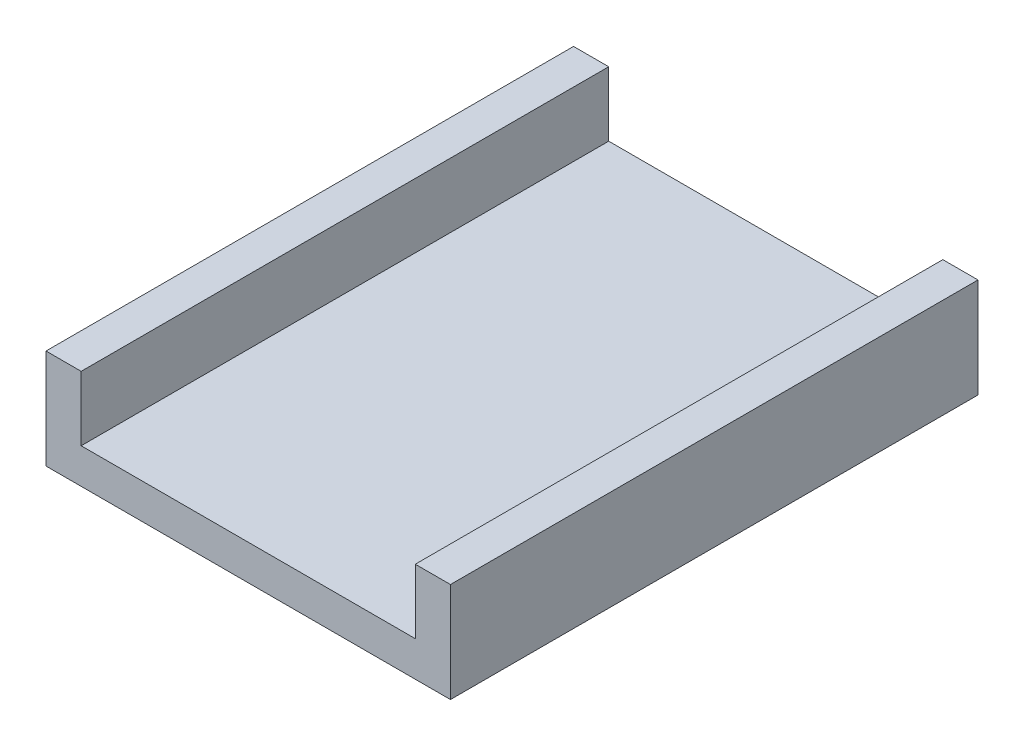
ISO-10303-21;
HEADER;
FILE_DESCRIPTION(('STEP AP214'),'2;1');
FILE_NAME('part.step','',(''),(''),'','','');
FILE_SCHEMA(('AUTOMOTIVE_DESIGN { 1 0 10303 214 1 1 1 1 }'));
ENDSEC;
DATA;
#1=APPLICATION_CONTEXT('core data for automotive mechanical design processes');
#2=APPLICATION_PROTOCOL_DEFINITION('international standard','automotive_design',2000,#1);
#3=PRODUCT_CONTEXT('',#1,'mechanical');
#4=PRODUCT('Part','Part','',(#3));
#5=PRODUCT_RELATED_PRODUCT_CATEGORY('part','',(#4));
#6=PRODUCT_DEFINITION_FORMATION('','',#4);
#7=PRODUCT_DEFINITION_CONTEXT('part definition',#1,'design');
#8=PRODUCT_DEFINITION('design','',#6,#7);
#9=PRODUCT_DEFINITION_SHAPE('','',#8);
#10=(LENGTH_UNIT() NAMED_UNIT(*) SI_UNIT(.MILLI.,.METRE.));
#11=(NAMED_UNIT(*) PLANE_ANGLE_UNIT() SI_UNIT($,.RADIAN.));
#12=(NAMED_UNIT(*) SI_UNIT($,.STERADIAN.) SOLID_ANGLE_UNIT());
#13=UNCERTAINTY_MEASURE_WITH_UNIT(LENGTH_MEASURE(1.E-05),#10,'distance_accuracy_value','');
#14=(GEOMETRIC_REPRESENTATION_CONTEXT(3) GLOBAL_UNCERTAINTY_ASSIGNED_CONTEXT((#13)) GLOBAL_UNIT_ASSIGNED_CONTEXT((#10,
#11,#12)) REPRESENTATION_CONTEXT('',''));
#15=CARTESIAN_POINT('',(0.,0.,0.));
#16=DIRECTION('',(0.,0.,1.));
#17=DIRECTION('',(1.,0.,0.));
#18=AXIS2_PLACEMENT_3D('',#15,#16,#17);
#19=CARTESIAN_POINT('',(0.,3.,0.));
#20=DIRECTION('',(0.,-1.,0.));
#21=DIRECTION('',(0.,0.,-1.));
#22=AXIS2_PLACEMENT_3D('',#19,#20,#21);
#23=PLANE('',#22);
#24=DIRECTION('',(0.,0.,1.));
#25=VECTOR('',#24,1.);
#26=CARTESIAN_POINT('',(14.25,3.,-22.5));
#27=LINE('',#26,#25);
#28=CARTESIAN_POINT('',(14.25,3.,-22.5));
#29=VERTEX_POINT('',#28);
#30=CARTESIAN_POINT('',(14.25,3.,22.5));
#31=VERTEX_POINT('',#30);
#32=EDGE_CURVE('E53',#29,#31,#27,.T.);
#33=ORIENTED_EDGE('',*,*,#32,.F.);
#34=DIRECTION('',(-1.,0.,0.));
#35=VECTOR('',#34,1.);
#36=CARTESIAN_POINT('',(-17.25,3.,-22.5));
#37=LINE('',#36,#35);
#38=CARTESIAN_POINT('',(-14.25,3.,-22.5));
#39=VERTEX_POINT('',#38);
#40=EDGE_CURVE('E39',#29,#39,#37,.T.);
#41=ORIENTED_EDGE('',*,*,#40,.T.);
#42=DIRECTION('',(0.,0.,-1.));
#43=VECTOR('',#42,1.);
#44=CARTESIAN_POINT('',(-14.25,3.,-22.5));
#45=LINE('',#44,#43);
#46=CARTESIAN_POINT('',(-14.25,3.,22.5));
#47=VERTEX_POINT('',#46);
#48=EDGE_CURVE('E123',#47,#39,#45,.T.);
#49=ORIENTED_EDGE('',*,*,#48,.F.);
#50=DIRECTION('',(1.,0.,0.));
#51=VECTOR('',#50,1.);
#52=CARTESIAN_POINT('',(-17.25,3.,22.5));
#53=LINE('',#52,#51);
#54=EDGE_CURVE('E58',#47,#31,#53,.T.);
#55=ORIENTED_EDGE('',*,*,#54,.T.);
#56=EDGE_LOOP('',(#33,#41,#49,#55));
#57=FACE_BOUND('',#56,.T.);
#58=ADVANCED_FACE('F35',(#57),#23,.F.);
#59=CARTESIAN_POINT('',(17.25,3.,22.5));
#60=DIRECTION('',(-1.,0.,0.));
#61=DIRECTION('',(0.,0.,1.));
#62=AXIS2_PLACEMENT_3D('',#59,#60,#61);
#63=PLANE('',#62);
#64=DIRECTION('',(0.,0.,-1.));
#65=VECTOR('',#64,1.);
#66=CARTESIAN_POINT('',(17.25,0.,22.5));
#67=LINE('',#66,#65);
#68=CARTESIAN_POINT('',(17.25,0.,22.5));
#69=VERTEX_POINT('',#68);
#70=CARTESIAN_POINT('',(17.25,0.,-22.5));
#71=VERTEX_POINT('',#70);
#72=EDGE_CURVE('E151',#69,#71,#67,.T.);
#73=ORIENTED_EDGE('',*,*,#72,.T.);
#74=DIRECTION('',(0.,-1.,0.));
#75=VECTOR('',#74,1.);
#76=CARTESIAN_POINT('',(17.25,3.,-22.5));
#77=LINE('',#76,#75);
#78=CARTESIAN_POINT('',(17.25,8.5,-22.5));
#79=VERTEX_POINT('',#78);
#80=EDGE_CURVE('E11',#79,#71,#77,.T.);
#81=ORIENTED_EDGE('',*,*,#80,.F.);
#82=DIRECTION('',(0.,0.,-1.));
#83=VECTOR('',#82,1.);
#84=CARTESIAN_POINT('',(17.25,8.5,-22.5));
#85=LINE('',#84,#83);
#86=CARTESIAN_POINT('',(17.25,8.5,22.5));
#87=VERTEX_POINT('',#86);
#88=EDGE_CURVE('E118',#87,#79,#85,.T.);
#89=ORIENTED_EDGE('',*,*,#88,.F.);
#90=DIRECTION('',(0.,-1.,0.));
#91=VECTOR('',#90,1.);
#92=CARTESIAN_POINT('',(17.25,3.,22.5));
#93=LINE('',#92,#91);
#94=EDGE_CURVE('E169',#87,#69,#93,.T.);
#95=ORIENTED_EDGE('',*,*,#94,.T.);
#96=EDGE_LOOP('',(#73,#81,#89,#95));
#97=FACE_BOUND('',#96,.T.);
#98=ADVANCED_FACE('F37',(#97),#63,.F.);
#99=CARTESIAN_POINT('',(-17.25,3.,-22.5));
#100=DIRECTION('',(0.,0.,1.));
#101=DIRECTION('',(1.,0.,0.));
#102=AXIS2_PLACEMENT_3D('',#99,#100,#101);
#103=PLANE('',#102);
#104=DIRECTION('',(-1.,0.,0.));
#105=VECTOR('',#104,1.);
#106=CARTESIAN_POINT('',(-17.25,0.,-22.5));
#107=LINE('',#106,#105);
#108=CARTESIAN_POINT('',(-17.25,0.,-22.5));
#109=VERTEX_POINT('',#108);
#110=EDGE_CURVE('E157',#71,#109,#107,.T.);
#111=ORIENTED_EDGE('',*,*,#110,.T.);
#112=DIRECTION('',(0.,-1.,0.));
#113=VECTOR('',#112,1.);
#114=CARTESIAN_POINT('',(-17.25,3.,-22.5));
#115=LINE('',#114,#113);
#116=CARTESIAN_POINT('',(-17.25,8.5,-22.5));
#117=VERTEX_POINT('',#116);
#118=EDGE_CURVE('E45',#117,#109,#115,.T.);
#119=ORIENTED_EDGE('',*,*,#118,.F.);
#120=DIRECTION('',(-1.,0.,0.));
#121=VECTOR('',#120,1.);
#122=CARTESIAN_POINT('',(-14.25,8.5,-22.5));
#123=LINE('',#122,#121);
#124=CARTESIAN_POINT('',(-14.25,8.5,-22.5));
#125=VERTEX_POINT('',#124);
#126=EDGE_CURVE('E126',#125,#117,#123,.T.);
#127=ORIENTED_EDGE('',*,*,#126,.F.);
#128=DIRECTION('',(0.,-1.,0.));
#129=VECTOR('',#128,1.);
#130=CARTESIAN_POINT('',(-14.25,8.5,-22.5));
#131=LINE('',#130,#129);
#132=EDGE_CURVE('E140',#125,#39,#131,.T.);
#133=ORIENTED_EDGE('',*,*,#132,.T.);
#134=ORIENTED_EDGE('',*,*,#40,.F.);
#135=DIRECTION('',(0.,-1.,0.));
#136=VECTOR('',#135,1.);
#137=CARTESIAN_POINT('',(14.25,8.5,-22.5));
#138=LINE('',#137,#136);
#139=CARTESIAN_POINT('',(14.25,8.5,-22.5));
#140=VERTEX_POINT('',#139);
#141=EDGE_CURVE('E105',#140,#29,#138,.T.);
#142=ORIENTED_EDGE('',*,*,#141,.F.);
#143=DIRECTION('',(-1.,0.,0.));
#144=VECTOR('',#143,1.);
#145=CARTESIAN_POINT('',(14.25,8.5,-22.5));
#146=LINE('',#145,#144);
#147=EDGE_CURVE('E112',#79,#140,#146,.T.);
#148=ORIENTED_EDGE('',*,*,#147,.F.);
#149=ORIENTED_EDGE('',*,*,#80,.T.);
#150=EDGE_LOOP('',(#111,#119,#127,#133,#134,#142,#148,#149));
#151=FACE_BOUND('',#150,.T.);
#152=ADVANCED_FACE('F121',(#151),#103,.F.);
#153=CARTESIAN_POINT('',(-17.25,3.,22.5));
#154=DIRECTION('',(1.,0.,0.));
#155=DIRECTION('',(0.,0.,-1.));
#156=AXIS2_PLACEMENT_3D('',#153,#154,#155);
#157=PLANE('',#156);
#158=DIRECTION('',(0.,0.,1.));
#159=VECTOR('',#158,1.);
#160=CARTESIAN_POINT('',(-17.25,0.,22.5));
#161=LINE('',#160,#159);
#162=CARTESIAN_POINT('',(-17.25,0.,22.5));
#163=VERTEX_POINT('',#162);
#164=EDGE_CURVE('E162',#109,#163,#161,.T.);
#165=ORIENTED_EDGE('',*,*,#164,.T.);
#166=DIRECTION('',(0.,-1.,0.));
#167=VECTOR('',#166,1.);
#168=CARTESIAN_POINT('',(-17.25,3.,22.5));
#169=LINE('',#168,#167);
#170=CARTESIAN_POINT('',(-17.25,8.5,22.5));
#171=VERTEX_POINT('',#170);
#172=EDGE_CURVE('E171',#171,#163,#169,.T.);
#173=ORIENTED_EDGE('',*,*,#172,.F.);
#174=DIRECTION('',(0.,0.,1.));
#175=VECTOR('',#174,1.);
#176=CARTESIAN_POINT('',(-17.25,8.5,-22.5));
#177=LINE('',#176,#175);
#178=EDGE_CURVE('E133',#117,#171,#177,.T.);
#179=ORIENTED_EDGE('',*,*,#178,.F.);
#180=ORIENTED_EDGE('',*,*,#118,.T.);
#181=EDGE_LOOP('',(#165,#173,#179,#180));
#182=FACE_BOUND('',#181,.T.);
#183=ADVANCED_FACE('F178',(#182),#157,.F.);
#184=CARTESIAN_POINT('',(-17.25,3.,22.5));
#185=DIRECTION('',(0.,0.,-1.));
#186=DIRECTION('',(-1.,0.,0.));
#187=AXIS2_PLACEMENT_3D('',#184,#185,#186);
#188=PLANE('',#187);
#189=DIRECTION('',(1.,0.,0.));
#190=VECTOR('',#189,1.);
#191=CARTESIAN_POINT('',(-17.25,0.,22.5));
#192=LINE('',#191,#190);
#193=EDGE_CURVE('E167',#163,#69,#192,.T.);
#194=ORIENTED_EDGE('',*,*,#193,.T.);
#195=ORIENTED_EDGE('',*,*,#94,.F.);
#196=DIRECTION('',(1.,0.,0.));
#197=VECTOR('',#196,1.);
#198=CARTESIAN_POINT('',(17.25,8.5,22.5));
#199=LINE('',#198,#197);
#200=CARTESIAN_POINT('',(14.25,8.5,22.5));
#201=VERTEX_POINT('',#200);
#202=EDGE_CURVE('E111',#201,#87,#199,.T.);
#203=ORIENTED_EDGE('',*,*,#202,.F.);
#204=DIRECTION('',(0.,-1.,0.));
#205=VECTOR('',#204,1.);
#206=CARTESIAN_POINT('',(14.25,8.5,22.5));
#207=LINE('',#206,#205);
#208=EDGE_CURVE('E107',#201,#31,#207,.T.);
#209=ORIENTED_EDGE('',*,*,#208,.T.);
#210=ORIENTED_EDGE('',*,*,#54,.F.);
#211=DIRECTION('',(0.,-1.,0.));
#212=VECTOR('',#211,1.);
#213=CARTESIAN_POINT('',(-14.25,8.5,22.5));
#214=LINE('',#213,#212);
#215=CARTESIAN_POINT('',(-14.25,8.5,22.5));
#216=VERTEX_POINT('',#215);
#217=EDGE_CURVE('E147',#216,#47,#214,.T.);
#218=ORIENTED_EDGE('',*,*,#217,.F.);
#219=DIRECTION('',(1.,0.,0.));
#220=VECTOR('',#219,1.);
#221=CARTESIAN_POINT('',(-17.25,8.5,22.5));
#222=LINE('',#221,#220);
#223=EDGE_CURVE('E136',#171,#216,#222,.T.);
#224=ORIENTED_EDGE('',*,*,#223,.F.);
#225=ORIENTED_EDGE('',*,*,#172,.T.);
#226=EDGE_LOOP('',(#194,#195,#203,#209,#210,#218,#224,#225));
#227=FACE_BOUND('',#226,.T.);
#228=ADVANCED_FACE('F184',(#227),#188,.F.);
#229=CARTESIAN_POINT('',(0.,0.,0.));
#230=DIRECTION('',(0.,-1.,0.));
#231=DIRECTION('',(0.,0.,-1.));
#232=AXIS2_PLACEMENT_3D('',#229,#230,#231);
#233=PLANE('',#232);
#234=ORIENTED_EDGE('',*,*,#72,.F.);
#235=ORIENTED_EDGE('',*,*,#193,.F.);
#236=ORIENTED_EDGE('',*,*,#164,.F.);
#237=ORIENTED_EDGE('',*,*,#110,.F.);
#238=EDGE_LOOP('',(#234,#235,#236,#237));
#239=FACE_BOUND('',#238,.T.);
#240=ADVANCED_FACE('F182',(#239),#233,.T.);
#241=CARTESIAN_POINT('',(-14.25,8.5,-22.5));
#242=DIRECTION('',(-1.,0.,0.));
#243=DIRECTION('',(0.,0.,1.));
#244=AXIS2_PLACEMENT_3D('',#241,#242,#243);
#245=PLANE('',#244);
#246=ORIENTED_EDGE('',*,*,#48,.T.);
#247=ORIENTED_EDGE('',*,*,#132,.F.);
#248=DIRECTION('',(0.,0.,-1.));
#249=VECTOR('',#248,1.);
#250=CARTESIAN_POINT('',(-14.25,8.5,-22.5));
#251=LINE('',#250,#249);
#252=EDGE_CURVE('E138',#216,#125,#251,.T.);
#253=ORIENTED_EDGE('',*,*,#252,.F.);
#254=ORIENTED_EDGE('',*,*,#217,.T.);
#255=EDGE_LOOP('',(#246,#247,#253,#254));
#256=FACE_BOUND('',#255,.T.);
#257=ADVANCED_FACE('F189',(#256),#245,.F.);
#258=CARTESIAN_POINT('',(0.,8.5,0.));
#259=DIRECTION('',(0.,1.,0.));
#260=DIRECTION('',(0.,0.,1.));
#261=AXIS2_PLACEMENT_3D('',#258,#259,#260);
#262=PLANE('',#261);
#263=ORIENTED_EDGE('',*,*,#126,.T.);
#264=ORIENTED_EDGE('',*,*,#178,.T.);
#265=ORIENTED_EDGE('',*,*,#223,.T.);
#266=ORIENTED_EDGE('',*,*,#252,.T.);
#267=EDGE_LOOP('',(#263,#264,#265,#266));
#268=FACE_BOUND('',#267,.T.);
#269=ADVANCED_FACE('F191',(#268),#262,.T.);
#270=CARTESIAN_POINT('',(14.25,8.5,-22.5));
#271=DIRECTION('',(1.,0.,0.));
#272=DIRECTION('',(0.,0.,-1.));
#273=AXIS2_PLACEMENT_3D('',#270,#271,#272);
#274=PLANE('',#273);
#275=ORIENTED_EDGE('',*,*,#32,.T.);
#276=ORIENTED_EDGE('',*,*,#208,.F.);
#277=DIRECTION('',(0.,0.,1.));
#278=VECTOR('',#277,1.);
#279=CARTESIAN_POINT('',(14.25,8.5,-22.5));
#280=LINE('',#279,#278);
#281=EDGE_CURVE('E101',#140,#201,#280,.T.);
#282=ORIENTED_EDGE('',*,*,#281,.F.);
#283=ORIENTED_EDGE('',*,*,#141,.T.);
#284=EDGE_LOOP('',(#275,#276,#282,#283));
#285=FACE_BOUND('',#284,.T.);
#286=ADVANCED_FACE('F103',(#285),#274,.F.);
#287=CARTESIAN_POINT('',(0.,8.5,0.));
#288=DIRECTION('',(0.,-1.,0.));
#289=DIRECTION('',(0.,0.,-1.));
#290=AXIS2_PLACEMENT_3D('',#287,#288,#289);
#291=PLANE('',#290);
#292=ORIENTED_EDGE('',*,*,#147,.T.);
#293=ORIENTED_EDGE('',*,*,#281,.T.);
#294=ORIENTED_EDGE('',*,*,#202,.T.);
#295=ORIENTED_EDGE('',*,*,#88,.T.);
#296=EDGE_LOOP('',(#292,#293,#294,#295));
#297=FACE_BOUND('',#296,.T.);
#298=ADVANCED_FACE('F116',(#297),#291,.F.);
#299=CLOSED_SHELL('',(#58,#98,#152,#183,#228,#240,#257,#269,#286,#298));
#300=MANIFOLD_SOLID_BREP('B2',#299);
#301=ADVANCED_BREP_SHAPE_REPRESENTATION('',(#18,#300),#14);
#302=SHAPE_DEFINITION_REPRESENTATION(#9,#301);
ENDSEC;
END-ISO-10303-21;
